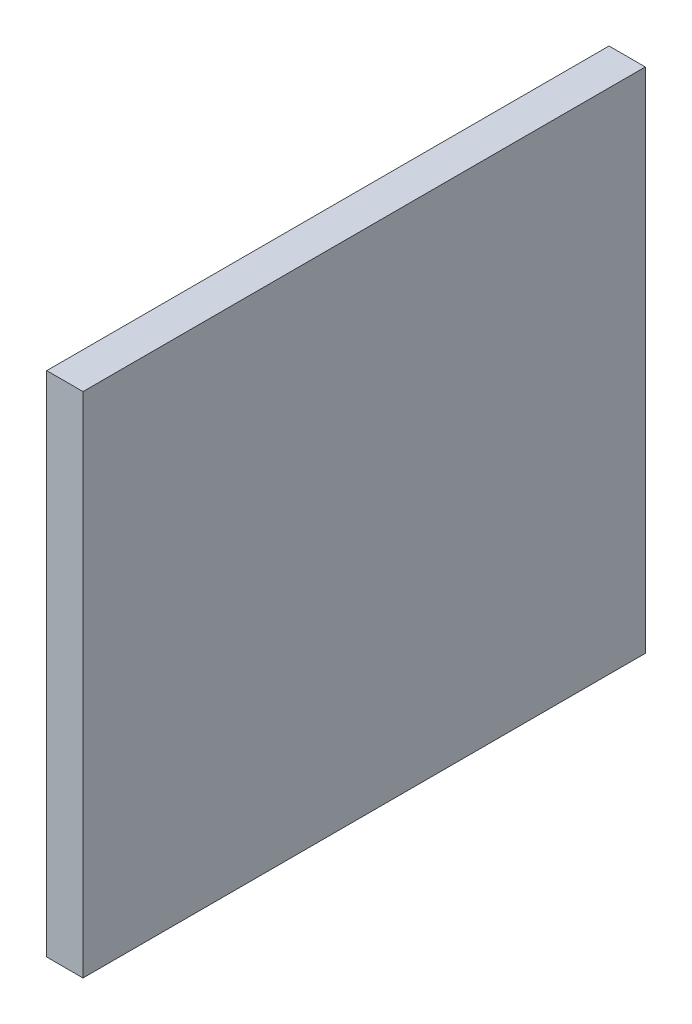
ISO-10303-21;
HEADER;
FILE_DESCRIPTION(('STEP AP214'),'2;1');
FILE_NAME('part.step','',(''),(''),'','','');
FILE_SCHEMA(('AUTOMOTIVE_DESIGN { 1 0 10303 214 1 1 1 1 }'));
ENDSEC;
DATA;
#1=APPLICATION_CONTEXT('core data for automotive mechanical design processes');
#2=APPLICATION_PROTOCOL_DEFINITION('international standard','automotive_design',2000,#1);
#3=PRODUCT_CONTEXT('',#1,'mechanical');
#4=PRODUCT('Part','Part','',(#3));
#5=PRODUCT_RELATED_PRODUCT_CATEGORY('part','',(#4));
#6=PRODUCT_DEFINITION_FORMATION('','',#4);
#7=PRODUCT_DEFINITION_CONTEXT('part definition',#1,'design');
#8=PRODUCT_DEFINITION('design','',#6,#7);
#9=PRODUCT_DEFINITION_SHAPE('','',#8);
#10=(LENGTH_UNIT() NAMED_UNIT(*) SI_UNIT(.MILLI.,.METRE.));
#11=(NAMED_UNIT(*) PLANE_ANGLE_UNIT() SI_UNIT($,.RADIAN.));
#12=(NAMED_UNIT(*) SI_UNIT($,.STERADIAN.) SOLID_ANGLE_UNIT());
#13=UNCERTAINTY_MEASURE_WITH_UNIT(LENGTH_MEASURE(1.E-05),#10,'distance_accuracy_value','');
#14=(GEOMETRIC_REPRESENTATION_CONTEXT(3) GLOBAL_UNCERTAINTY_ASSIGNED_CONTEXT((#13)) GLOBAL_UNIT_ASSIGNED_CONTEXT((#10,
#11,#12)) REPRESENTATION_CONTEXT('',''));
#15=CARTESIAN_POINT('',(0.,0.,0.));
#16=DIRECTION('',(0.,0.,1.));
#17=DIRECTION('',(1.,0.,0.));
#18=AXIS2_PLACEMENT_3D('',#15,#16,#17);
#19=CARTESIAN_POINT('',(150.,-140.,155.));
#20=DIRECTION('',(0.,1.,0.));
#21=DIRECTION('',(0.,0.,1.));
#22=AXIS2_PLACEMENT_3D('',#19,#20,#21);
#23=PLANE('',#22);
#24=DIRECTION('',(1.,0.,0.));
#25=VECTOR('',#24,1.);
#26=CARTESIAN_POINT('',(150.,-140.,0.));
#27=LINE('',#26,#25);
#28=CARTESIAN_POINT('',(150.,-140.,0.));
#29=VERTEX_POINT('',#28);
#30=CARTESIAN_POINT('',(160.,-140.,0.));
#31=VERTEX_POINT('',#30);
#32=EDGE_CURVE('E107',#29,#31,#27,.T.);
#33=ORIENTED_EDGE('',*,*,#32,.T.);
#34=DIRECTION('',(0.,0.,-1.));
#35=VECTOR('',#34,1.);
#36=CARTESIAN_POINT('',(160.,-140.,155.));
#37=LINE('',#36,#35);
#38=CARTESIAN_POINT('',(160.,-140.,155.));
#39=VERTEX_POINT('',#38);
#40=EDGE_CURVE('E11',#39,#31,#37,.T.);
#41=ORIENTED_EDGE('',*,*,#40,.F.);
#42=DIRECTION('',(1.,0.,0.));
#43=VECTOR('',#42,1.);
#44=CARTESIAN_POINT('',(150.,-140.,155.));
#45=LINE('',#44,#43);
#46=CARTESIAN_POINT('',(150.,-140.,155.));
#47=VERTEX_POINT('',#46);
#48=EDGE_CURVE('E91',#47,#39,#45,.T.);
#49=ORIENTED_EDGE('',*,*,#48,.F.);
#50=DIRECTION('',(0.,0.,-1.));
#51=VECTOR('',#50,1.);
#52=CARTESIAN_POINT('',(150.,-140.,155.));
#53=LINE('',#52,#51);
#54=EDGE_CURVE('E103',#47,#29,#53,.T.);
#55=ORIENTED_EDGE('',*,*,#54,.T.);
#56=EDGE_LOOP('',(#33,#41,#49,#55));
#57=FACE_BOUND('',#56,.T.);
#58=ADVANCED_FACE('F39',(#57),#23,.F.);
#59=CARTESIAN_POINT('',(160.,0.,155.));
#60=DIRECTION('',(-1.,0.,0.));
#61=DIRECTION('',(0.,-1.,0.));
#62=AXIS2_PLACEMENT_3D('',#59,#60,#61);
#63=PLANE('',#62);
#64=DIRECTION('',(0.,1.,0.));
#65=VECTOR('',#64,1.);
#66=CARTESIAN_POINT('',(160.,0.,0.));
#67=LINE('',#66,#65);
#68=CARTESIAN_POINT('',(160.,0.,0.));
#69=VERTEX_POINT('',#68);
#70=EDGE_CURVE('E96',#31,#69,#67,.T.);
#71=ORIENTED_EDGE('',*,*,#70,.T.);
#72=DIRECTION('',(0.,0.,-1.));
#73=VECTOR('',#72,1.);
#74=CARTESIAN_POINT('',(160.,0.,155.));
#75=LINE('',#74,#73);
#76=CARTESIAN_POINT('',(160.,0.,155.));
#77=VERTEX_POINT('',#76);
#78=EDGE_CURVE('E48',#77,#69,#75,.T.);
#79=ORIENTED_EDGE('',*,*,#78,.F.);
#80=DIRECTION('',(0.,1.,0.));
#81=VECTOR('',#80,1.);
#82=CARTESIAN_POINT('',(160.,0.,155.));
#83=LINE('',#82,#81);
#84=EDGE_CURVE('E86',#39,#77,#83,.T.);
#85=ORIENTED_EDGE('',*,*,#84,.F.);
#86=ORIENTED_EDGE('',*,*,#40,.T.);
#87=EDGE_LOOP('',(#71,#79,#85,#86));
#88=FACE_BOUND('',#87,.T.);
#89=ADVANCED_FACE('F95',(#88),#63,.F.);
#90=CARTESIAN_POINT('',(150.,0.,155.));
#91=DIRECTION('',(0.,-1.,0.));
#92=DIRECTION('',(0.,0.,-1.));
#93=AXIS2_PLACEMENT_3D('',#90,#91,#92);
#94=PLANE('',#93);
#95=DIRECTION('',(-1.,0.,0.));
#96=VECTOR('',#95,1.);
#97=CARTESIAN_POINT('',(150.,0.,0.));
#98=LINE('',#97,#96);
#99=CARTESIAN_POINT('',(150.,0.,0.));
#100=VERTEX_POINT('',#99);
#101=EDGE_CURVE('E73',#69,#100,#98,.T.);
#102=ORIENTED_EDGE('',*,*,#101,.T.);
#103=DIRECTION('',(0.,0.,-1.));
#104=VECTOR('',#103,1.);
#105=CARTESIAN_POINT('',(150.,0.,155.));
#106=LINE('',#105,#104);
#107=CARTESIAN_POINT('',(150.,0.,155.));
#108=VERTEX_POINT('',#107);
#109=EDGE_CURVE('E98',#108,#100,#106,.T.);
#110=ORIENTED_EDGE('',*,*,#109,.F.);
#111=DIRECTION('',(-1.,0.,0.));
#112=VECTOR('',#111,1.);
#113=CARTESIAN_POINT('',(150.,0.,155.));
#114=LINE('',#113,#112);
#115=EDGE_CURVE('E89',#77,#108,#114,.T.);
#116=ORIENTED_EDGE('',*,*,#115,.F.);
#117=ORIENTED_EDGE('',*,*,#78,.T.);
#118=EDGE_LOOP('',(#102,#110,#116,#117));
#119=FACE_BOUND('',#118,.T.);
#120=ADVANCED_FACE('F99',(#119),#94,.F.);
#121=CARTESIAN_POINT('',(150.,-140.,155.));
#122=DIRECTION('',(1.,0.,0.));
#123=DIRECTION('',(0.,1.,0.));
#124=AXIS2_PLACEMENT_3D('',#121,#122,#123);
#125=PLANE('',#124);
#126=DIRECTION('',(0.,-1.,0.));
#127=VECTOR('',#126,1.);
#128=CARTESIAN_POINT('',(150.,-140.,0.));
#129=LINE('',#128,#127);
#130=EDGE_CURVE('E79',#100,#29,#129,.T.);
#131=ORIENTED_EDGE('',*,*,#130,.T.);
#132=ORIENTED_EDGE('',*,*,#54,.F.);
#133=DIRECTION('',(0.,-1.,0.));
#134=VECTOR('',#133,1.);
#135=CARTESIAN_POINT('',(150.,-140.,155.));
#136=LINE('',#135,#134);
#137=EDGE_CURVE('E56',#108,#47,#136,.T.);
#138=ORIENTED_EDGE('',*,*,#137,.F.);
#139=ORIENTED_EDGE('',*,*,#109,.T.);
#140=EDGE_LOOP('',(#131,#132,#138,#139));
#141=FACE_BOUND('',#140,.T.);
#142=ADVANCED_FACE('F120',(#141),#125,.F.);
#143=CARTESIAN_POINT('',(0.,0.,155.));
#144=DIRECTION('',(0.,0.,-1.));
#145=DIRECTION('',(-1.,0.,0.));
#146=AXIS2_PLACEMENT_3D('',#143,#144,#145);
#147=PLANE('',#146);
#148=ORIENTED_EDGE('',*,*,#48,.T.);
#149=ORIENTED_EDGE('',*,*,#84,.T.);
#150=ORIENTED_EDGE('',*,*,#115,.T.);
#151=ORIENTED_EDGE('',*,*,#137,.T.);
#152=EDGE_LOOP('',(#148,#149,#150,#151));
#153=FACE_BOUND('',#152,.T.);
#154=ADVANCED_FACE('F87',(#153),#147,.F.);
#155=CARTESIAN_POINT('',(0.,0.,0.));
#156=DIRECTION('',(0.,0.,-1.));
#157=DIRECTION('',(-1.,0.,0.));
#158=AXIS2_PLACEMENT_3D('',#155,#156,#157);
#159=PLANE('',#158);
#160=ORIENTED_EDGE('',*,*,#32,.F.);
#161=ORIENTED_EDGE('',*,*,#130,.F.);
#162=ORIENTED_EDGE('',*,*,#101,.F.);
#163=ORIENTED_EDGE('',*,*,#70,.F.);
#164=EDGE_LOOP('',(#160,#161,#162,#163));
#165=FACE_BOUND('',#164,.T.);
#166=ADVANCED_FACE('F123',(#165),#159,.T.);
#167=CLOSED_SHELL('',(#58,#89,#120,#142,#154,#166));
#168=MANIFOLD_SOLID_BREP('B2',#167);
#169=ADVANCED_BREP_SHAPE_REPRESENTATION('',(#18,#168),#14);
#170=SHAPE_DEFINITION_REPRESENTATION(#9,#169);
ENDSEC;
END-ISO-10303-21;
